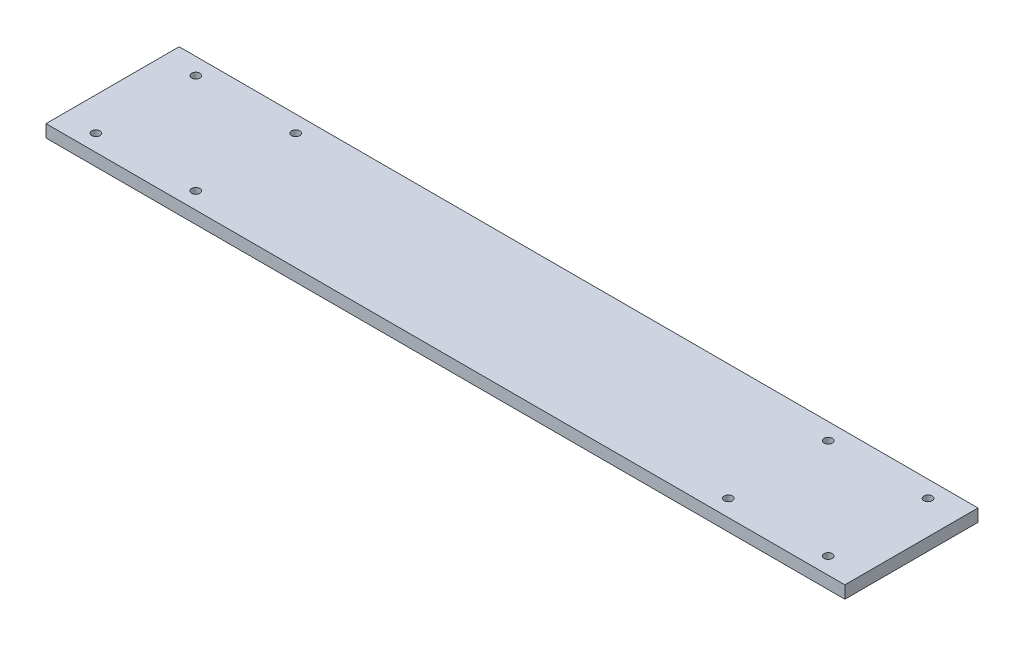
ISO-10303-21;
HEADER;
FILE_DESCRIPTION(('STEP AP214'),'2;1');
FILE_NAME('part.step','',(''),(''),'','','');
FILE_SCHEMA(('AUTOMOTIVE_DESIGN { 1 0 10303 214 1 1 1 1 }'));
ENDSEC;
DATA;
#1=APPLICATION_CONTEXT('core data for automotive mechanical design processes');
#2=APPLICATION_PROTOCOL_DEFINITION('international standard','automotive_design',2000,#1);
#3=PRODUCT_CONTEXT('',#1,'mechanical');
#4=PRODUCT('Part','Part','',(#3));
#5=PRODUCT_RELATED_PRODUCT_CATEGORY('part','',(#4));
#6=PRODUCT_DEFINITION_FORMATION('','',#4);
#7=PRODUCT_DEFINITION_CONTEXT('part definition',#1,'design');
#8=PRODUCT_DEFINITION('design','',#6,#7);
#9=PRODUCT_DEFINITION_SHAPE('','',#8);
#10=(LENGTH_UNIT() NAMED_UNIT(*) SI_UNIT(.MILLI.,.METRE.));
#11=(NAMED_UNIT(*) PLANE_ANGLE_UNIT() SI_UNIT($,.RADIAN.));
#12=(NAMED_UNIT(*) SI_UNIT($,.STERADIAN.) SOLID_ANGLE_UNIT());
#13=UNCERTAINTY_MEASURE_WITH_UNIT(LENGTH_MEASURE(1.E-05),#10,'distance_accuracy_value','');
#14=(GEOMETRIC_REPRESENTATION_CONTEXT(3) GLOBAL_UNCERTAINTY_ASSIGNED_CONTEXT((#13)) GLOBAL_UNIT_ASSIGNED_CONTEXT((#10,
#11,#12)) REPRESENTATION_CONTEXT('',''));
#15=CARTESIAN_POINT('',(0.,0.,0.));
#16=DIRECTION('',(0.,0.,1.));
#17=DIRECTION('',(1.,0.,0.));
#18=AXIS2_PLACEMENT_3D('',#15,#16,#17);
#19=CARTESIAN_POINT('',(304.8,9.525,50.8));
#20=DIRECTION('',(-1.,0.,0.));
#21=DIRECTION('',(0.,0.,1.));
#22=AXIS2_PLACEMENT_3D('',#19,#20,#21);
#23=PLANE('',#22);
#24=DIRECTION('',(0.,0.,-1.));
#25=VECTOR('',#24,1.);
#26=CARTESIAN_POINT('',(304.8,0.,50.8));
#27=LINE('',#26,#25);
#28=CARTESIAN_POINT('',(304.8,0.,50.8));
#29=VERTEX_POINT('',#28);
#30=CARTESIAN_POINT('',(304.8,0.,-50.8));
#31=VERTEX_POINT('',#30);
#32=EDGE_CURVE('E98',#29,#31,#27,.T.);
#33=ORIENTED_EDGE('',*,*,#32,.T.);
#34=DIRECTION('',(0.,-1.,0.));
#35=VECTOR('',#34,1.);
#36=CARTESIAN_POINT('',(304.8,9.525,-50.8));
#37=LINE('',#36,#35);
#38=CARTESIAN_POINT('',(304.8,9.525,-50.8));
#39=VERTEX_POINT('',#38);
#40=EDGE_CURVE('E11',#39,#31,#37,.T.);
#41=ORIENTED_EDGE('',*,*,#40,.F.);
#42=DIRECTION('',(0.,0.,-1.));
#43=VECTOR('',#42,1.);
#44=CARTESIAN_POINT('',(304.8,9.525,50.8));
#45=LINE('',#44,#43);
#46=CARTESIAN_POINT('',(304.8,9.525,50.8));
#47=VERTEX_POINT('',#46);
#48=EDGE_CURVE('E86',#47,#39,#45,.T.);
#49=ORIENTED_EDGE('',*,*,#48,.F.);
#50=DIRECTION('',(0.,-1.,0.));
#51=VECTOR('',#50,1.);
#52=CARTESIAN_POINT('',(304.8,9.525,50.8));
#53=LINE('',#52,#51);
#54=EDGE_CURVE('E94',#47,#29,#53,.T.);
#55=ORIENTED_EDGE('',*,*,#54,.T.);
#56=EDGE_LOOP('',(#33,#41,#49,#55));
#57=FACE_BOUND('',#56,.T.);
#58=ADVANCED_FACE('F35',(#57),#23,.F.);
#59=CARTESIAN_POINT('',(-304.8,9.525,-50.8));
#60=DIRECTION('',(0.,0.,1.));
#61=DIRECTION('',(1.,0.,0.));
#62=AXIS2_PLACEMENT_3D('',#59,#60,#61);
#63=PLANE('',#62);
#64=DIRECTION('',(-1.,0.,0.));
#65=VECTOR('',#64,1.);
#66=CARTESIAN_POINT('',(-304.8,0.,-50.8));
#67=LINE('',#66,#65);
#68=CARTESIAN_POINT('',(-304.8,0.,-50.8));
#69=VERTEX_POINT('',#68);
#70=EDGE_CURVE('E90',#31,#69,#67,.T.);
#71=ORIENTED_EDGE('',*,*,#70,.T.);
#72=DIRECTION('',(0.,-1.,0.));
#73=VECTOR('',#72,1.);
#74=CARTESIAN_POINT('',(-304.8,9.525,-50.8));
#75=LINE('',#74,#73);
#76=CARTESIAN_POINT('',(-304.8,9.525,-50.8));
#77=VERTEX_POINT('',#76);
#78=EDGE_CURVE('E43',#77,#69,#75,.T.);
#79=ORIENTED_EDGE('',*,*,#78,.F.);
#80=DIRECTION('',(-1.,0.,0.));
#81=VECTOR('',#80,1.);
#82=CARTESIAN_POINT('',(-304.8,9.525,-50.8));
#83=LINE('',#82,#81);
#84=EDGE_CURVE('E81',#39,#77,#83,.T.);
#85=ORIENTED_EDGE('',*,*,#84,.F.);
#86=ORIENTED_EDGE('',*,*,#40,.T.);
#87=EDGE_LOOP('',(#71,#79,#85,#86));
#88=FACE_BOUND('',#87,.T.);
#89=ADVANCED_FACE('F89',(#88),#63,.F.);
#90=CARTESIAN_POINT('',(-304.8,9.525,50.8));
#91=DIRECTION('',(1.,0.,0.));
#92=DIRECTION('',(0.,0.,-1.));
#93=AXIS2_PLACEMENT_3D('',#90,#91,#92);
#94=PLANE('',#93);
#95=DIRECTION('',(0.,0.,1.));
#96=VECTOR('',#95,1.);
#97=CARTESIAN_POINT('',(-304.8,0.,50.8));
#98=LINE('',#97,#96);
#99=CARTESIAN_POINT('',(-304.8,0.,50.8));
#100=VERTEX_POINT('',#99);
#101=EDGE_CURVE('E68',#69,#100,#98,.T.);
#102=ORIENTED_EDGE('',*,*,#101,.T.);
#103=DIRECTION('',(0.,-1.,0.));
#104=VECTOR('',#103,1.);
#105=CARTESIAN_POINT('',(-304.8,9.525,50.8));
#106=LINE('',#105,#104);
#107=CARTESIAN_POINT('',(-304.8,9.525,50.8));
#108=VERTEX_POINT('',#107);
#109=EDGE_CURVE('E91',#108,#100,#106,.T.);
#110=ORIENTED_EDGE('',*,*,#109,.F.);
#111=DIRECTION('',(0.,0.,1.));
#112=VECTOR('',#111,1.);
#113=CARTESIAN_POINT('',(-304.8,9.525,50.8));
#114=LINE('',#113,#112);
#115=EDGE_CURVE('E84',#77,#108,#114,.T.);
#116=ORIENTED_EDGE('',*,*,#115,.F.);
#117=ORIENTED_EDGE('',*,*,#78,.T.);
#118=EDGE_LOOP('',(#102,#110,#116,#117));
#119=FACE_BOUND('',#118,.T.);
#120=ADVANCED_FACE('F92',(#119),#94,.F.);
#121=CARTESIAN_POINT('',(-304.8,9.525,50.8));
#122=DIRECTION('',(0.,0.,-1.));
#123=DIRECTION('',(-1.,0.,0.));
#124=AXIS2_PLACEMENT_3D('',#121,#122,#123);
#125=PLANE('',#124);
#126=DIRECTION('',(1.,0.,0.));
#127=VECTOR('',#126,1.);
#128=CARTESIAN_POINT('',(-304.8,0.,50.8));
#129=LINE('',#128,#127);
#130=EDGE_CURVE('E74',#100,#29,#129,.T.);
#131=ORIENTED_EDGE('',*,*,#130,.T.);
#132=ORIENTED_EDGE('',*,*,#54,.F.);
#133=DIRECTION('',(1.,0.,0.));
#134=VECTOR('',#133,1.);
#135=CARTESIAN_POINT('',(-304.8,9.525,50.8));
#136=LINE('',#135,#134);
#137=EDGE_CURVE('E51',#108,#47,#136,.T.);
#138=ORIENTED_EDGE('',*,*,#137,.F.);
#139=ORIENTED_EDGE('',*,*,#109,.T.);
#140=EDGE_LOOP('',(#131,#132,#138,#139));
#141=FACE_BOUND('',#140,.T.);
#142=ADVANCED_FACE('F106',(#141),#125,.F.);
#143=CARTESIAN_POINT('',(0.,9.525,0.));
#144=DIRECTION('',(0.,-1.,0.));
#145=DIRECTION('',(0.,0.,-1.));
#146=AXIS2_PLACEMENT_3D('',#143,#144,#145);
#147=PLANE('',#146);
#148=CARTESIAN_POINT('',(279.4,9.525,38.1));
#149=DIRECTION('',(0.,1.,0.));
#150=DIRECTION('',(0.,0.,1.));
#151=AXIS2_PLACEMENT_3D('',#148,#149,#150);
#152=CIRCLE('',#151,3.17499999999998);
#153=CARTESIAN_POINT('',(279.4,9.525,41.275));
#154=VERTEX_POINT('',#153);
#155=EDGE_CURVE('E156',#154,#154,#152,.T.);
#156=ORIENTED_EDGE('',*,*,#155,.F.);
#157=EDGE_LOOP('',(#156));
#158=FACE_BOUND('',#157,.T.);
#159=CARTESIAN_POINT('',(279.4,9.525,-38.1));
#160=DIRECTION('',(0.,1.,0.));
#161=DIRECTION('',(0.,0.,1.));
#162=AXIS2_PLACEMENT_3D('',#159,#160,#161);
#163=CIRCLE('',#162,3.17499999999998);
#164=CARTESIAN_POINT('',(279.4,9.525,-34.925));
#165=VERTEX_POINT('',#164);
#166=EDGE_CURVE('E150',#165,#165,#163,.T.);
#167=ORIENTED_EDGE('',*,*,#166,.F.);
#168=EDGE_LOOP('',(#167));
#169=FACE_BOUND('',#168,.T.);
#170=CARTESIAN_POINT('',(203.2,9.525,-38.1));
#171=DIRECTION('',(0.,1.,0.));
#172=DIRECTION('',(0.,0.,1.));
#173=AXIS2_PLACEMENT_3D('',#170,#171,#172);
#174=CIRCLE('',#173,3.17500000000001);
#175=CARTESIAN_POINT('',(203.2,9.525,-34.925));
#176=VERTEX_POINT('',#175);
#177=EDGE_CURVE('E144',#176,#176,#174,.T.);
#178=ORIENTED_EDGE('',*,*,#177,.F.);
#179=EDGE_LOOP('',(#178));
#180=FACE_BOUND('',#179,.T.);
#181=CARTESIAN_POINT('',(203.2,9.525,38.1));
#182=DIRECTION('',(0.,1.,0.));
#183=DIRECTION('',(0.,0.,1.));
#184=AXIS2_PLACEMENT_3D('',#181,#182,#183);
#185=CIRCLE('',#184,3.17500000000001);
#186=CARTESIAN_POINT('',(203.2,9.525,41.275));
#187=VERTEX_POINT('',#186);
#188=EDGE_CURVE('E138',#187,#187,#185,.T.);
#189=ORIENTED_EDGE('',*,*,#188,.F.);
#190=EDGE_LOOP('',(#189));
#191=FACE_BOUND('',#190,.T.);
#192=CARTESIAN_POINT('',(-203.2,9.525,38.1));
#193=DIRECTION('',(0.,1.,0.));
#194=DIRECTION('',(0.,0.,1.));
#195=AXIS2_PLACEMENT_3D('',#192,#193,#194);
#196=CIRCLE('',#195,3.17500000000001);
#197=CARTESIAN_POINT('',(-203.2,9.525,41.275));
#198=VERTEX_POINT('',#197);
#199=EDGE_CURVE('E132',#198,#198,#196,.T.);
#200=ORIENTED_EDGE('',*,*,#199,.F.);
#201=EDGE_LOOP('',(#200));
#202=FACE_BOUND('',#201,.T.);
#203=CARTESIAN_POINT('',(-279.4,9.525,38.1));
#204=DIRECTION('',(0.,1.,0.));
#205=DIRECTION('',(0.,0.,1.));
#206=AXIS2_PLACEMENT_3D('',#203,#204,#205);
#207=CIRCLE('',#206,3.17499999999998);
#208=CARTESIAN_POINT('',(-279.4,9.525,41.275));
#209=VERTEX_POINT('',#208);
#210=EDGE_CURVE('E126',#209,#209,#207,.T.);
#211=ORIENTED_EDGE('',*,*,#210,.F.);
#212=EDGE_LOOP('',(#211));
#213=FACE_BOUND('',#212,.T.);
#214=CARTESIAN_POINT('',(-279.4,9.525,-38.1));
#215=DIRECTION('',(0.,1.,0.));
#216=DIRECTION('',(0.,0.,1.));
#217=AXIS2_PLACEMENT_3D('',#214,#215,#216);
#218=CIRCLE('',#217,3.17499999999998);
#219=CARTESIAN_POINT('',(-279.4,9.525,-34.925));
#220=VERTEX_POINT('',#219);
#221=EDGE_CURVE('E120',#220,#220,#218,.T.);
#222=ORIENTED_EDGE('',*,*,#221,.F.);
#223=EDGE_LOOP('',(#222));
#224=FACE_BOUND('',#223,.T.);
#225=CARTESIAN_POINT('',(-203.2,9.525,-38.1));
#226=DIRECTION('',(0.,1.,0.));
#227=DIRECTION('',(0.,0.,1.));
#228=AXIS2_PLACEMENT_3D('',#225,#226,#227);
#229=CIRCLE('',#228,3.17500000000001);
#230=CARTESIAN_POINT('',(-203.2,9.525,-34.925));
#231=VERTEX_POINT('',#230);
#232=EDGE_CURVE('E114',#231,#231,#229,.T.);
#233=ORIENTED_EDGE('',*,*,#232,.F.);
#234=EDGE_LOOP('',(#233));
#235=FACE_BOUND('',#234,.T.);
#236=ORIENTED_EDGE('',*,*,#48,.T.);
#237=ORIENTED_EDGE('',*,*,#84,.T.);
#238=ORIENTED_EDGE('',*,*,#115,.T.);
#239=ORIENTED_EDGE('',*,*,#137,.T.);
#240=EDGE_LOOP('',(#236,#237,#238,#239));
#241=FACE_BOUND('',#240,.T.);
#242=ADVANCED_FACE('F82',(#158,#169,#180,#191,#202,#213,#224,#235,#241),#147,.F.);
#243=CARTESIAN_POINT('',(0.,0.,0.));
#244=DIRECTION('',(0.,-1.,0.));
#245=DIRECTION('',(0.,0.,-1.));
#246=AXIS2_PLACEMENT_3D('',#243,#244,#245);
#247=PLANE('',#246);
#248=CARTESIAN_POINT('',(279.4,0.,38.1));
#249=DIRECTION('',(0.,1.,0.));
#250=DIRECTION('',(0.,0.,1.));
#251=AXIS2_PLACEMENT_3D('',#248,#249,#250);
#252=CIRCLE('',#251,3.17499999999998);
#253=CARTESIAN_POINT('',(279.4,0.,41.275));
#254=VERTEX_POINT('',#253);
#255=EDGE_CURVE('E153',#254,#254,#252,.T.);
#256=ORIENTED_EDGE('',*,*,#255,.T.);
#257=EDGE_LOOP('',(#256));
#258=FACE_BOUND('',#257,.T.);
#259=CARTESIAN_POINT('',(279.4,0.,-38.1));
#260=DIRECTION('',(0.,1.,0.));
#261=DIRECTION('',(0.,0.,1.));
#262=AXIS2_PLACEMENT_3D('',#259,#260,#261);
#263=CIRCLE('',#262,3.17499999999998);
#264=CARTESIAN_POINT('',(279.4,0.,-34.925));
#265=VERTEX_POINT('',#264);
#266=EDGE_CURVE('E147',#265,#265,#263,.T.);
#267=ORIENTED_EDGE('',*,*,#266,.T.);
#268=EDGE_LOOP('',(#267));
#269=FACE_BOUND('',#268,.T.);
#270=CARTESIAN_POINT('',(203.2,0.,-38.1));
#271=DIRECTION('',(0.,1.,0.));
#272=DIRECTION('',(0.,0.,1.));
#273=AXIS2_PLACEMENT_3D('',#270,#271,#272);
#274=CIRCLE('',#273,3.17500000000001);
#275=CARTESIAN_POINT('',(203.2,0.,-34.925));
#276=VERTEX_POINT('',#275);
#277=EDGE_CURVE('E141',#276,#276,#274,.T.);
#278=ORIENTED_EDGE('',*,*,#277,.T.);
#279=EDGE_LOOP('',(#278));
#280=FACE_BOUND('',#279,.T.);
#281=CARTESIAN_POINT('',(203.2,0.,38.1));
#282=DIRECTION('',(0.,1.,0.));
#283=DIRECTION('',(0.,0.,1.));
#284=AXIS2_PLACEMENT_3D('',#281,#282,#283);
#285=CIRCLE('',#284,3.17500000000001);
#286=CARTESIAN_POINT('',(203.2,0.,41.275));
#287=VERTEX_POINT('',#286);
#288=EDGE_CURVE('E135',#287,#287,#285,.T.);
#289=ORIENTED_EDGE('',*,*,#288,.T.);
#290=EDGE_LOOP('',(#289));
#291=FACE_BOUND('',#290,.T.);
#292=CARTESIAN_POINT('',(-203.2,0.,38.1));
#293=DIRECTION('',(0.,1.,0.));
#294=DIRECTION('',(0.,0.,1.));
#295=AXIS2_PLACEMENT_3D('',#292,#293,#294);
#296=CIRCLE('',#295,3.17500000000001);
#297=CARTESIAN_POINT('',(-203.2,0.,41.275));
#298=VERTEX_POINT('',#297);
#299=EDGE_CURVE('E129',#298,#298,#296,.T.);
#300=ORIENTED_EDGE('',*,*,#299,.T.);
#301=EDGE_LOOP('',(#300));
#302=FACE_BOUND('',#301,.T.);
#303=CARTESIAN_POINT('',(-279.4,0.,38.1));
#304=DIRECTION('',(0.,1.,0.));
#305=DIRECTION('',(0.,0.,1.));
#306=AXIS2_PLACEMENT_3D('',#303,#304,#305);
#307=CIRCLE('',#306,3.17499999999998);
#308=CARTESIAN_POINT('',(-279.4,0.,41.275));
#309=VERTEX_POINT('',#308);
#310=EDGE_CURVE('E123',#309,#309,#307,.T.);
#311=ORIENTED_EDGE('',*,*,#310,.T.);
#312=EDGE_LOOP('',(#311));
#313=FACE_BOUND('',#312,.T.);
#314=CARTESIAN_POINT('',(-279.4,0.,-38.1));
#315=DIRECTION('',(0.,1.,0.));
#316=DIRECTION('',(0.,0.,1.));
#317=AXIS2_PLACEMENT_3D('',#314,#315,#316);
#318=CIRCLE('',#317,3.17499999999998);
#319=CARTESIAN_POINT('',(-279.4,0.,-34.925));
#320=VERTEX_POINT('',#319);
#321=EDGE_CURVE('E117',#320,#320,#318,.T.);
#322=ORIENTED_EDGE('',*,*,#321,.T.);
#323=EDGE_LOOP('',(#322));
#324=FACE_BOUND('',#323,.T.);
#325=CARTESIAN_POINT('',(-203.2,0.,-38.1));
#326=DIRECTION('',(0.,1.,0.));
#327=DIRECTION('',(0.,0.,1.));
#328=AXIS2_PLACEMENT_3D('',#325,#326,#327);
#329=CIRCLE('',#328,3.17500000000001);
#330=CARTESIAN_POINT('',(-203.2,0.,-34.925));
#331=VERTEX_POINT('',#330);
#332=EDGE_CURVE('E101',#331,#331,#329,.T.);
#333=ORIENTED_EDGE('',*,*,#332,.T.);
#334=EDGE_LOOP('',(#333));
#335=FACE_BOUND('',#334,.T.);
#336=ORIENTED_EDGE('',*,*,#32,.F.);
#337=ORIENTED_EDGE('',*,*,#130,.F.);
#338=ORIENTED_EDGE('',*,*,#101,.F.);
#339=ORIENTED_EDGE('',*,*,#70,.F.);
#340=EDGE_LOOP('',(#336,#337,#338,#339));
#341=FACE_BOUND('',#340,.T.);
#342=ADVANCED_FACE('F109',(#258,#269,#280,#291,#302,#313,#324,#335,#341),#247,.T.);
#343=CARTESIAN_POINT('',(-203.2,9.525,-38.1));
#344=DIRECTION('',(0.,1.,0.));
#345=DIRECTION('',(0.,0.,1.));
#346=AXIS2_PLACEMENT_3D('',#343,#344,#345);
#347=CYLINDRICAL_SURFACE('',#346,3.17500000000001);
#348=ORIENTED_EDGE('',*,*,#332,.F.);
#349=EDGE_LOOP('',(#348));
#350=FACE_BOUND('',#349,.T.);
#351=ORIENTED_EDGE('',*,*,#232,.T.);
#352=EDGE_LOOP('',(#351));
#353=FACE_BOUND('',#352,.T.);
#354=ADVANCED_FACE('F179',(#350,#353),#347,.F.);
#355=CARTESIAN_POINT('',(-279.4,9.525,-38.1));
#356=DIRECTION('',(0.,1.,0.));
#357=DIRECTION('',(0.,0.,1.));
#358=AXIS2_PLACEMENT_3D('',#355,#356,#357);
#359=CYLINDRICAL_SURFACE('',#358,3.17499999999998);
#360=ORIENTED_EDGE('',*,*,#321,.F.);
#361=EDGE_LOOP('',(#360));
#362=FACE_BOUND('',#361,.T.);
#363=ORIENTED_EDGE('',*,*,#221,.T.);
#364=EDGE_LOOP('',(#363));
#365=FACE_BOUND('',#364,.T.);
#366=ADVANCED_FACE('F181',(#362,#365),#359,.F.);
#367=CARTESIAN_POINT('',(-279.4,9.525,38.1));
#368=DIRECTION('',(0.,1.,0.));
#369=DIRECTION('',(0.,0.,1.));
#370=AXIS2_PLACEMENT_3D('',#367,#368,#369);
#371=CYLINDRICAL_SURFACE('',#370,3.17499999999998);
#372=ORIENTED_EDGE('',*,*,#310,.F.);
#373=EDGE_LOOP('',(#372));
#374=FACE_BOUND('',#373,.T.);
#375=ORIENTED_EDGE('',*,*,#210,.T.);
#376=EDGE_LOOP('',(#375));
#377=FACE_BOUND('',#376,.T.);
#378=ADVANCED_FACE('F188',(#374,#377),#371,.F.);
#379=CARTESIAN_POINT('',(-203.2,9.525,38.1));
#380=DIRECTION('',(0.,1.,0.));
#381=DIRECTION('',(0.,0.,1.));
#382=AXIS2_PLACEMENT_3D('',#379,#380,#381);
#383=CYLINDRICAL_SURFACE('',#382,3.17500000000001);
#384=ORIENTED_EDGE('',*,*,#299,.F.);
#385=EDGE_LOOP('',(#384));
#386=FACE_BOUND('',#385,.T.);
#387=ORIENTED_EDGE('',*,*,#199,.T.);
#388=EDGE_LOOP('',(#387));
#389=FACE_BOUND('',#388,.T.);
#390=ADVANCED_FACE('F235',(#386,#389),#383,.F.);
#391=CARTESIAN_POINT('',(203.2,9.525,38.1));
#392=DIRECTION('',(0.,1.,0.));
#393=DIRECTION('',(0.,0.,1.));
#394=AXIS2_PLACEMENT_3D('',#391,#392,#393);
#395=CYLINDRICAL_SURFACE('',#394,3.17500000000001);
#396=ORIENTED_EDGE('',*,*,#288,.F.);
#397=EDGE_LOOP('',(#396));
#398=FACE_BOUND('',#397,.T.);
#399=ORIENTED_EDGE('',*,*,#188,.T.);
#400=EDGE_LOOP('',(#399));
#401=FACE_BOUND('',#400,.T.);
#402=ADVANCED_FACE('F245',(#398,#401),#395,.F.);
#403=CARTESIAN_POINT('',(203.2,9.525,-38.1));
#404=DIRECTION('',(0.,1.,0.));
#405=DIRECTION('',(0.,0.,1.));
#406=AXIS2_PLACEMENT_3D('',#403,#404,#405);
#407=CYLINDRICAL_SURFACE('',#406,3.17500000000001);
#408=ORIENTED_EDGE('',*,*,#277,.F.);
#409=EDGE_LOOP('',(#408));
#410=FACE_BOUND('',#409,.T.);
#411=ORIENTED_EDGE('',*,*,#177,.T.);
#412=EDGE_LOOP('',(#411));
#413=FACE_BOUND('',#412,.T.);
#414=ADVANCED_FACE('F255',(#410,#413),#407,.F.);
#415=CARTESIAN_POINT('',(279.4,9.525,-38.1));
#416=DIRECTION('',(0.,1.,0.));
#417=DIRECTION('',(0.,0.,1.));
#418=AXIS2_PLACEMENT_3D('',#415,#416,#417);
#419=CYLINDRICAL_SURFACE('',#418,3.17499999999998);
#420=ORIENTED_EDGE('',*,*,#266,.F.);
#421=EDGE_LOOP('',(#420));
#422=FACE_BOUND('',#421,.T.);
#423=ORIENTED_EDGE('',*,*,#166,.T.);
#424=EDGE_LOOP('',(#423));
#425=FACE_BOUND('',#424,.T.);
#426=ADVANCED_FACE('F265',(#422,#425),#419,.F.);
#427=CARTESIAN_POINT('',(279.4,9.525,38.1));
#428=DIRECTION('',(0.,1.,0.));
#429=DIRECTION('',(0.,0.,1.));
#430=AXIS2_PLACEMENT_3D('',#427,#428,#429);
#431=CYLINDRICAL_SURFACE('',#430,3.17499999999998);
#432=ORIENTED_EDGE('',*,*,#255,.F.);
#433=EDGE_LOOP('',(#432));
#434=FACE_BOUND('',#433,.T.);
#435=ORIENTED_EDGE('',*,*,#155,.T.);
#436=EDGE_LOOP('',(#435));
#437=FACE_BOUND('',#436,.T.);
#438=ADVANCED_FACE('F160',(#434,#437),#431,.F.);
#439=CLOSED_SHELL('',(#58,#89,#120,#142,#242,#342,#354,#366,#378,#390,#402,#414,#426,#438));
#440=MANIFOLD_SOLID_BREP('B2',#439);
#441=ADVANCED_BREP_SHAPE_REPRESENTATION('',(#18,#440),#14);
#442=SHAPE_DEFINITION_REPRESENTATION(#9,#441);
ENDSEC;
END-ISO-10303-21;
